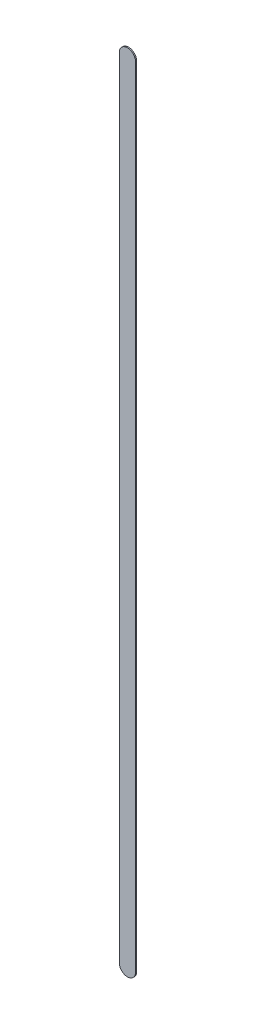
ISO-10303-21;
HEADER;
FILE_DESCRIPTION(('STEP AP214'),'2;1');
FILE_NAME('part.step','',(''),(''),'','','');
FILE_SCHEMA(('AUTOMOTIVE_DESIGN { 1 0 10303 214 1 1 1 1 }'));
ENDSEC;
DATA;
#1=APPLICATION_CONTEXT('core data for automotive mechanical design processes');
#2=APPLICATION_PROTOCOL_DEFINITION('international standard','automotive_design',2000,#1);
#3=PRODUCT_CONTEXT('',#1,'mechanical');
#4=PRODUCT('Part','Part','',(#3));
#5=PRODUCT_RELATED_PRODUCT_CATEGORY('part','',(#4));
#6=PRODUCT_DEFINITION_FORMATION('','',#4);
#7=PRODUCT_DEFINITION_CONTEXT('part definition',#1,'design');
#8=PRODUCT_DEFINITION('design','',#6,#7);
#9=PRODUCT_DEFINITION_SHAPE('','',#8);
#10=(LENGTH_UNIT() NAMED_UNIT(*) SI_UNIT(.MILLI.,.METRE.));
#11=(NAMED_UNIT(*) PLANE_ANGLE_UNIT() SI_UNIT($,.RADIAN.));
#12=(NAMED_UNIT(*) SI_UNIT($,.STERADIAN.) SOLID_ANGLE_UNIT());
#13=UNCERTAINTY_MEASURE_WITH_UNIT(LENGTH_MEASURE(1.E-05),#10,'distance_accuracy_value','');
#14=(GEOMETRIC_REPRESENTATION_CONTEXT(3) GLOBAL_UNCERTAINTY_ASSIGNED_CONTEXT((#13)) GLOBAL_UNIT_ASSIGNED_CONTEXT((#10,
#11,#12)) REPRESENTATION_CONTEXT('',''));
#15=CARTESIAN_POINT('',(0.,0.,0.));
#16=DIRECTION('',(0.,0.,1.));
#17=DIRECTION('',(1.,0.,0.));
#18=AXIS2_PLACEMENT_3D('',#15,#16,#17);
#19=CARTESIAN_POINT('',(178.685,-115.189,0.));
#20=DIRECTION('',(0.,0.,1.));
#21=DIRECTION('',(1.,0.,0.));
#22=AXIS2_PLACEMENT_3D('',#19,#20,#21);
#23=PLANE('',#22);
#24=DIRECTION('',(0.,1.,0.));
#25=VECTOR('',#24,1.);
#26=CARTESIAN_POINT('',(178.685,-115.189,0.));
#27=LINE('',#26,#25);
#28=CARTESIAN_POINT('',(178.685,-115.189,0.));
#29=VERTEX_POINT('',#28);
#30=CARTESIAN_POINT('',(178.685,-91.059,0.));
#31=VERTEX_POINT('',#30);
#32=EDGE_CURVE('E73',#29,#31,#27,.T.);
#33=ORIENTED_EDGE('',*,*,#32,.T.);
#34=CARTESIAN_POINT('',(178.435,-91.059,0.));
#35=DIRECTION('',(0.,0.,1.));
#36=DIRECTION('',(1.,0.,0.));
#37=AXIS2_PLACEMENT_3D('',#34,#35,#36);
#38=CIRCLE('',#37,0.25);
#39=CARTESIAN_POINT('',(178.185,-91.059,0.));
#40=VERTEX_POINT('',#39);
#41=EDGE_CURVE('E71',#31,#40,#38,.T.);
#42=ORIENTED_EDGE('',*,*,#41,.T.);
#43=DIRECTION('',(0.,-1.,0.));
#44=VECTOR('',#43,1.);
#45=CARTESIAN_POINT('',(178.185,-91.059,0.));
#46=LINE('',#45,#44);
#47=CARTESIAN_POINT('',(178.185,-115.189,0.));
#48=VERTEX_POINT('',#47);
#49=EDGE_CURVE('E58',#40,#48,#46,.T.);
#50=ORIENTED_EDGE('',*,*,#49,.T.);
#51=CARTESIAN_POINT('',(178.435,-115.189,0.));
#52=DIRECTION('',(0.,0.,1.));
#53=DIRECTION('',(-1.,0.,0.));
#54=AXIS2_PLACEMENT_3D('',#51,#52,#53);
#55=CIRCLE('',#54,0.25);
#56=EDGE_CURVE('E11',#48,#29,#55,.T.);
#57=ORIENTED_EDGE('',*,*,#56,.T.);
#58=EDGE_LOOP('',(#33,#42,#50,#57));
#59=FACE_BOUND('',#58,.T.);
#60=ADVANCED_FACE('F17',(#59),#23,.T.);
#61=CARTESIAN_POINT('',(178.685,-115.189,-0.035));
#62=DIRECTION('',(0.,0.,1.));
#63=DIRECTION('',(1.,0.,0.));
#64=AXIS2_PLACEMENT_3D('',#61,#62,#63);
#65=PLANE('',#64);
#66=CARTESIAN_POINT('',(178.435,-115.189,-0.035));
#67=DIRECTION('',(0.,0.,1.));
#68=DIRECTION('',(-1.,0.,0.));
#69=AXIS2_PLACEMENT_3D('',#66,#67,#68);
#70=CIRCLE('',#69,0.25);
#71=CARTESIAN_POINT('',(178.185,-115.189,-0.035));
#72=VERTEX_POINT('',#71);
#73=CARTESIAN_POINT('',(178.685,-115.189,-0.035));
#74=VERTEX_POINT('',#73);
#75=EDGE_CURVE('E27',#72,#74,#70,.T.);
#76=ORIENTED_EDGE('',*,*,#75,.F.);
#77=DIRECTION('',(0.,-1.,0.));
#78=VECTOR('',#77,1.);
#79=CARTESIAN_POINT('',(178.185,-91.059,-0.035));
#80=LINE('',#79,#78);
#81=CARTESIAN_POINT('',(178.185,-91.059,-0.035));
#82=VERTEX_POINT('',#81);
#83=EDGE_CURVE('E20',#82,#72,#80,.T.);
#84=ORIENTED_EDGE('',*,*,#83,.F.);
#85=CARTESIAN_POINT('',(178.435,-91.059,-0.035));
#86=DIRECTION('',(0.,0.,1.));
#87=DIRECTION('',(1.,0.,0.));
#88=AXIS2_PLACEMENT_3D('',#85,#86,#87);
#89=CIRCLE('',#88,0.25);
#90=CARTESIAN_POINT('',(178.685,-91.059,-0.035));
#91=VERTEX_POINT('',#90);
#92=EDGE_CURVE('E80',#91,#82,#89,.T.);
#93=ORIENTED_EDGE('',*,*,#92,.F.);
#94=DIRECTION('',(0.,1.,0.));
#95=VECTOR('',#94,1.);
#96=CARTESIAN_POINT('',(178.685,-115.189,-0.035));
#97=LINE('',#96,#95);
#98=EDGE_CURVE('E104',#74,#91,#97,.T.);
#99=ORIENTED_EDGE('',*,*,#98,.F.);
#100=EDGE_LOOP('',(#76,#84,#93,#99));
#101=FACE_BOUND('',#100,.T.);
#102=ADVANCED_FACE('F98',(#101),#65,.F.);
#103=CARTESIAN_POINT('',(178.435,-115.189,-0.035));
#104=DIRECTION('',(0.,0.,-1.));
#105=DIRECTION('',(-1.,0.,0.));
#106=AXIS2_PLACEMENT_3D('',#103,#104,#105);
#107=CYLINDRICAL_SURFACE('',#106,0.25);
#108=ORIENTED_EDGE('',*,*,#75,.T.);
#109=DIRECTION('',(0.,0.,1.));
#110=VECTOR('',#109,1.);
#111=CARTESIAN_POINT('',(178.685,-115.189,-0.035));
#112=LINE('',#111,#110);
#113=EDGE_CURVE('E87',#74,#29,#112,.T.);
#114=ORIENTED_EDGE('',*,*,#113,.T.);
#115=ORIENTED_EDGE('',*,*,#56,.F.);
#116=DIRECTION('',(0.,0.,1.));
#117=VECTOR('',#116,1.);
#118=CARTESIAN_POINT('',(178.185,-115.189,-0.035));
#119=LINE('',#118,#117);
#120=EDGE_CURVE('E65',#72,#48,#119,.T.);
#121=ORIENTED_EDGE('',*,*,#120,.F.);
#122=EDGE_LOOP('',(#108,#114,#115,#121));
#123=FACE_BOUND('',#122,.T.);
#124=ADVANCED_FACE('F108',(#123),#107,.T.);
#125=CARTESIAN_POINT('',(178.185,-91.059,-0.035));
#126=DIRECTION('',(1.,0.,0.));
#127=DIRECTION('',(0.,1.,0.));
#128=AXIS2_PLACEMENT_3D('',#125,#126,#127);
#129=PLANE('',#128);
#130=ORIENTED_EDGE('',*,*,#83,.T.);
#131=ORIENTED_EDGE('',*,*,#120,.T.);
#132=ORIENTED_EDGE('',*,*,#49,.F.);
#133=DIRECTION('',(0.,0.,1.));
#134=VECTOR('',#133,1.);
#135=CARTESIAN_POINT('',(178.185,-91.059,-0.035));
#136=LINE('',#135,#134);
#137=EDGE_CURVE('E63',#82,#40,#136,.T.);
#138=ORIENTED_EDGE('',*,*,#137,.F.);
#139=EDGE_LOOP('',(#130,#131,#132,#138));
#140=FACE_BOUND('',#139,.T.);
#141=ADVANCED_FACE('F61',(#140),#129,.F.);
#142=CARTESIAN_POINT('',(178.435,-91.059,-0.035));
#143=DIRECTION('',(0.,0.,-1.));
#144=DIRECTION('',(1.,0.,0.));
#145=AXIS2_PLACEMENT_3D('',#142,#143,#144);
#146=CYLINDRICAL_SURFACE('',#145,0.25);
#147=ORIENTED_EDGE('',*,*,#92,.T.);
#148=ORIENTED_EDGE('',*,*,#137,.T.);
#149=ORIENTED_EDGE('',*,*,#41,.F.);
#150=DIRECTION('',(0.,0.,1.));
#151=VECTOR('',#150,1.);
#152=CARTESIAN_POINT('',(178.685,-91.059,-0.035));
#153=LINE('',#152,#151);
#154=EDGE_CURVE('E198',#91,#31,#153,.T.);
#155=ORIENTED_EDGE('',*,*,#154,.F.);
#156=EDGE_LOOP('',(#147,#148,#149,#155));
#157=FACE_BOUND('',#156,.T.);
#158=ADVANCED_FACE('F78',(#157),#146,.T.);
#159=CARTESIAN_POINT('',(178.685,-115.189,-0.035));
#160=DIRECTION('',(-1.,0.,0.));
#161=DIRECTION('',(0.,0.,1.));
#162=AXIS2_PLACEMENT_3D('',#159,#160,#161);
#163=PLANE('',#162);
#164=ORIENTED_EDGE('',*,*,#98,.T.);
#165=ORIENTED_EDGE('',*,*,#154,.T.);
#166=ORIENTED_EDGE('',*,*,#32,.F.);
#167=ORIENTED_EDGE('',*,*,#113,.F.);
#168=EDGE_LOOP('',(#164,#165,#166,#167));
#169=FACE_BOUND('',#168,.T.);
#170=ADVANCED_FACE('F168',(#169),#163,.F.);
#171=CLOSED_SHELL('',(#60,#102,#124,#141,#158,#170));
#172=MANIFOLD_SOLID_BREP('B1',#171);
#173=ADVANCED_BREP_SHAPE_REPRESENTATION('',(#18,#172),#14);
#174=SHAPE_DEFINITION_REPRESENTATION(#9,#173);
ENDSEC;
END-ISO-10303-21;
